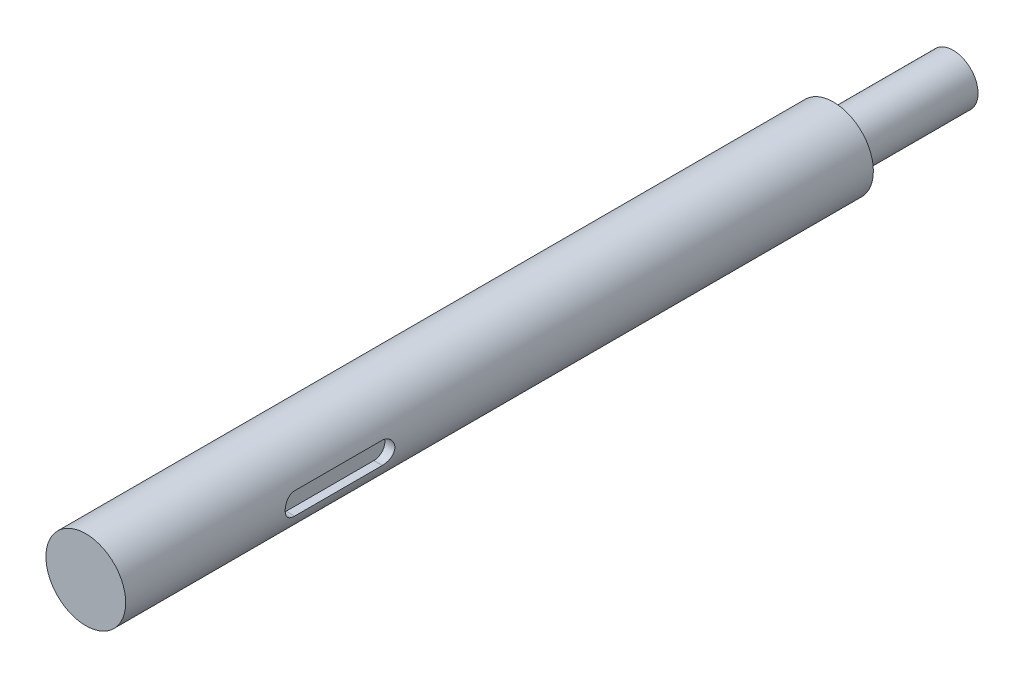
ISO-10303-21;
HEADER;
FILE_DESCRIPTION(('STEP AP214'),'2;1');
FILE_NAME('part.step','',(''),(''),'','','');
FILE_SCHEMA(('AUTOMOTIVE_DESIGN { 1 0 10303 214 1 1 1 1 }'));
ENDSEC;
DATA;
#1=APPLICATION_CONTEXT('core data for automotive mechanical design processes');
#2=APPLICATION_PROTOCOL_DEFINITION('international standard','automotive_design',2000,#1);
#3=PRODUCT_CONTEXT('',#1,'mechanical');
#4=PRODUCT('Part','Part','',(#3));
#5=PRODUCT_RELATED_PRODUCT_CATEGORY('part','',(#4));
#6=PRODUCT_DEFINITION_FORMATION('','',#4);
#7=PRODUCT_DEFINITION_CONTEXT('part definition',#1,'design');
#8=PRODUCT_DEFINITION('design','',#6,#7);
#9=PRODUCT_DEFINITION_SHAPE('','',#8);
#10=(LENGTH_UNIT() NAMED_UNIT(*) SI_UNIT(.MILLI.,.METRE.));
#11=(NAMED_UNIT(*) PLANE_ANGLE_UNIT() SI_UNIT($,.RADIAN.));
#12=(NAMED_UNIT(*) SI_UNIT($,.STERADIAN.) SOLID_ANGLE_UNIT());
#13=UNCERTAINTY_MEASURE_WITH_UNIT(LENGTH_MEASURE(1.E-05),#10,'distance_accuracy_value','');
#14=(GEOMETRIC_REPRESENTATION_CONTEXT(3) GLOBAL_UNCERTAINTY_ASSIGNED_CONTEXT((#13)) GLOBAL_UNIT_ASSIGNED_CONTEXT((#10,
#11,#12)) REPRESENTATION_CONTEXT('',''));
#15=CARTESIAN_POINT('',(0.,0.,0.));
#16=DIRECTION('',(0.,0.,1.));
#17=DIRECTION('',(1.,0.,0.));
#18=AXIS2_PLACEMENT_3D('',#15,#16,#17);
#19=CARTESIAN_POINT('',(0.,0.,75.));
#20=DIRECTION('',(0.,0.,-1.));
#21=DIRECTION('',(-1.,0.,0.));
#22=AXIS2_PLACEMENT_3D('',#19,#20,#21);
#23=CYLINDRICAL_SURFACE('',#22,4.);
#24=CARTESIAN_POINT('',(0.,0.,75.));
#25=DIRECTION('',(0.,0.,1.));
#26=DIRECTION('',(1.,0.,0.));
#27=AXIS2_PLACEMENT_3D('',#24,#25,#26);
#28=CIRCLE('',#27,4.);
#29=CARTESIAN_POINT('',(4.,0.,75.));
#30=VERTEX_POINT('',#29);
#31=EDGE_CURVE('E113',#30,#30,#28,.T.);
#32=ORIENTED_EDGE('',*,*,#31,.F.);
#33=EDGE_LOOP('',(#32));
#34=FACE_BOUND('',#33,.T.);
#35=CARTESIAN_POINT('',(0.,0.,0.));
#36=DIRECTION('',(0.,0.,1.));
#37=DIRECTION('',(1.,0.,0.));
#38=AXIS2_PLACEMENT_3D('',#35,#36,#37);
#39=CIRCLE('',#38,4.);
#40=CARTESIAN_POINT('',(4.,0.,0.));
#41=VERTEX_POINT('',#40);
#42=EDGE_CURVE('E108',#41,#41,#39,.T.);
#43=ORIENTED_EDGE('',*,*,#42,.T.);
#44=EDGE_LOOP('',(#43));
#45=FACE_BOUND('',#44,.T.);
#46=CARTESIAN_POINT('',(3.84577690460588,-1.1,49.1));
#47=CARTESIAN_POINT('',(3.84577460040045,-1.10000049269841,49.0696807589315));
#48=CARTESIAN_POINT('',(3.8461359051698,-1.09874566748106,49.0393766575331));
#49=CARTESIAN_POINT('',(3.84756203681956,-1.09374423671206,48.9789972986114));
#50=CARTESIAN_POINT('',(3.8486267265385,-1.08999811696688,48.9489219976278));
#51=CARTESIAN_POINT('',(3.85283178935487,-1.07508146609142,48.8595057773965));
#52=CARTESIAN_POINT('',(3.85698344992634,-1.06023236583058,48.8007828329138));
#53=CARTESIAN_POINT('',(3.86749429073186,-1.02121992442069,48.6867872682155));
#54=CARTESIAN_POINT('',(3.8738529957301,-0.997058588321974,48.6315139082323));
#55=CARTESIAN_POINT('',(3.88805746341656,-0.940141974920891,48.5257713764976));
#56=CARTESIAN_POINT('',(3.89590376528787,-0.907383579934376,48.4753039566655));
#57=CARTESIAN_POINT('',(3.91243077773866,-0.833280742703089,48.3793002677106));
#58=CARTESIAN_POINT('',(3.92112693966533,-0.791749945422331,48.3339105346198));
#59=CARTESIAN_POINT('',(3.9382414976702,-0.701678247007662,48.2506414673899));
#60=CARTESIAN_POINT('',(3.94665984806721,-0.653136199983694,48.2127633633269));
#61=CARTESIAN_POINT('',(3.96244402073585,-0.549393065255371,48.1449759516735));
#62=CARTESIAN_POINT('',(3.96978936402839,-0.494092230778886,48.1152141187069));
#63=CARTESIAN_POINT('',(3.98242060404427,-0.379038130327487,48.0654683298916));
#64=CARTESIAN_POINT('',(3.98770696570398,-0.319285873157936,48.0454821663488));
#65=CARTESIAN_POINT('',(3.99551517746231,-0.198562051593551,48.0163326555741));
#66=CARTESIAN_POINT('',(3.9981010136306,-0.137655284397289,48.0069183906103));
#67=CARTESIAN_POINT('',(4.00044095806972,-0.0150743060485403,47.9983894504216));
#68=CARTESIAN_POINT('',(4.0001955083333,0.0465997838154159,47.9992731675764));
#69=CARTESIAN_POINT('',(3.99694691239131,0.167212300268214,48.0111407920462));
#70=CARTESIAN_POINT('',(3.99401788272129,0.226179738834641,48.0218532551067));
#71=CARTESIAN_POINT('',(3.98581936328496,0.341444721358572,48.0526344602264));
#72=CARTESIAN_POINT('',(3.98054975923916,0.397742134802451,48.0727036591344));
#73=CARTESIAN_POINT('',(3.9681539914951,0.506751682908651,48.1218309757932));
#74=CARTESIAN_POINT('',(3.96100910185802,0.559420475085642,48.1509803471613));
#75=CARTESIAN_POINT('',(3.94562998514812,0.659209226826629,48.2173696725862));
#76=CARTESIAN_POINT('',(3.93739555434326,0.706328145503839,48.2546111406132));
#77=CARTESIAN_POINT('',(3.92041112186428,0.79529647866738,48.337555767899));
#78=CARTESIAN_POINT('',(3.91165306162229,0.836924921060689,48.3834945551086));
#79=CARTESIAN_POINT('',(3.8948461223239,0.911952002821714,48.4818034163998));
#80=CARTESIAN_POINT('',(3.88679744168146,0.945348344328879,48.5341752800743));
#81=CARTESIAN_POINT('',(3.87228478633302,1.00314930243698,48.6443761620977));
#82=CARTESIAN_POINT('',(3.86583304877767,1.02748516411955,48.7022428865896));
#83=CARTESIAN_POINT('',(3.85539806504079,1.06597848870995,48.8214362069388));
#84=CARTESIAN_POINT('',(3.85141109892312,1.08015129532198,48.8827574357255));
#85=CARTESIAN_POINT('',(3.84786904334958,1.09266385838806,48.9705257162275));
#86=CARTESIAN_POINT('',(3.84708593977816,1.09541503463923,48.9963581330875));
#87=CARTESIAN_POINT('',(3.8460399656814,1.09908122407721,49.0481228115318));
#88=CARTESIAN_POINT('',(3.84577628408222,1.09999909998117,49.0740548539989));
#89=CARTESIAN_POINT('',(3.84577690460588,1.1,49.1));
#90=B_SPLINE_CURVE_WITH_KNOTS('',3,(#46,#47,#48,#49,#50,#51,#52,#53,#54,#55,#56,#57,#58,#59,#60,
#61,#62,#63,#64,#65,#66,#67,#68,#69,#70,#71,#72,#73,#74,#75,#76,#77,#78,#79,#80,#81,#82,#83,#84,
#85,#86,#87,#88,#89),.UNSPECIFIED.,.F.,.F.,(4,2,2,2,2,2,2,2,2,2,2,2,2,2,2,2,2,2,2,2,2,4),(0.,
0.0908998964038968,0.181782072376462,0.362978852714695,0.54413664071091,0.725360215751237,
0.910911431607297,1.09649300758421,1.28525067794807,1.47396570040628,1.65810021684777,
1.84220598839281,2.02137546761453,2.20055369582064,2.38159411388996,2.56266843246602,
2.74962644608707,2.9366365871297,3.12503823887396,3.31315484832063,3.39106850263228,
3.46886039856523),.UNSPECIFIED.);
#91=CARTESIAN_POINT('',(3.84577690460588,-1.1,49.1));
#92=VERTEX_POINT('',#91);
#93=CARTESIAN_POINT('',(3.84577690460588,1.1,49.1));
#94=VERTEX_POINT('',#93);
#95=EDGE_CURVE('E112',#92,#94,#90,.T.);
#96=ORIENTED_EDGE('',*,*,#95,.F.);
#97=DIRECTION('',(0.,0.,-1.));
#98=VECTOR('',#97,1.);
#99=CARTESIAN_POINT('',(3.84577690460588,-1.1,75.));
#100=LINE('',#99,#98);
#101=CARTESIAN_POINT('',(3.84577690460588,-1.1,57.9));
#102=VERTEX_POINT('',#101);
#103=EDGE_CURVE('E11',#102,#92,#100,.T.);
#104=ORIENTED_EDGE('',*,*,#103,.F.);
#105=CARTESIAN_POINT('',(3.84577690460588,1.1,57.9));
#106=CARTESIAN_POINT('',(3.84577460040045,1.10000049269841,57.9303192410685));
#107=CARTESIAN_POINT('',(3.8461359051698,1.09874566748106,57.9606233424668));
#108=CARTESIAN_POINT('',(3.84756203681956,1.09374423671206,58.0210027013886));
#109=CARTESIAN_POINT('',(3.8486267265385,1.08999811696688,58.0510780023722));
#110=CARTESIAN_POINT('',(3.85283178935487,1.07508146609142,58.1404942226035));
#111=CARTESIAN_POINT('',(3.85698344992634,1.06023236583058,58.1992171670862));
#112=CARTESIAN_POINT('',(3.86749429073186,1.02121992442069,58.3132127317845));
#113=CARTESIAN_POINT('',(3.8738529957301,0.997058588321974,58.3684860917677));
#114=CARTESIAN_POINT('',(3.88805746341656,0.940141974920891,58.4742286235024));
#115=CARTESIAN_POINT('',(3.89590376528787,0.907383579934376,58.5246960433345));
#116=CARTESIAN_POINT('',(3.91243077773866,0.833280742703089,58.6206997322894));
#117=CARTESIAN_POINT('',(3.92112693966533,0.791749945422331,58.6660894653802));
#118=CARTESIAN_POINT('',(3.9382414976702,0.701678247007662,58.7493585326101));
#119=CARTESIAN_POINT('',(3.94665984806721,0.653136199983694,58.7872366366731));
#120=CARTESIAN_POINT('',(3.96244402073585,0.549393065255371,58.8550240483265));
#121=CARTESIAN_POINT('',(3.96978936402839,0.494092230778886,58.8847858812931));
#122=CARTESIAN_POINT('',(3.98242060404427,0.379038130327487,58.9345316701084));
#123=CARTESIAN_POINT('',(3.98770696570398,0.319285873157936,58.9545178336512));
#124=CARTESIAN_POINT('',(3.99551517746231,0.198562051593551,58.9836673444259));
#125=CARTESIAN_POINT('',(3.9981010136306,0.137655284397289,58.9930816093897));
#126=CARTESIAN_POINT('',(4.00044095806972,0.0150743060485413,59.0016105495784));
#127=CARTESIAN_POINT('',(4.0001955083333,-0.0465997838154154,59.0007268324236));
#128=CARTESIAN_POINT('',(3.99694691239131,-0.167212300268214,58.9888592079538));
#129=CARTESIAN_POINT('',(3.99401788272129,-0.226179738834641,58.9781467448933));
#130=CARTESIAN_POINT('',(3.98581936328496,-0.341444721358572,58.9473655397736));
#131=CARTESIAN_POINT('',(3.98054975923916,-0.397742134802451,58.9272963408656));
#132=CARTESIAN_POINT('',(3.9681539914951,-0.506751682908651,58.8781690242068));
#133=CARTESIAN_POINT('',(3.96100910185802,-0.559420475085642,58.8490196528387));
#134=CARTESIAN_POINT('',(3.94562998514812,-0.659209226826629,58.7826303274138));
#135=CARTESIAN_POINT('',(3.93739555434326,-0.706328145503839,58.7453888593867));
#136=CARTESIAN_POINT('',(3.92041112186428,-0.79529647866738,58.662444232101));
#137=CARTESIAN_POINT('',(3.91165306162229,-0.836924921060689,58.6165054448914));
#138=CARTESIAN_POINT('',(3.8948461223239,-0.911952002821714,58.5181965836002));
#139=CARTESIAN_POINT('',(3.88679744168146,-0.945348344328879,58.4658247199257));
#140=CARTESIAN_POINT('',(3.87228478633302,-1.00314930243698,58.3556238379023));
#141=CARTESIAN_POINT('',(3.86583304877767,-1.02748516411955,58.2977571134104));
#142=CARTESIAN_POINT('',(3.85539806504079,-1.06597848870995,58.1785637930612));
#143=CARTESIAN_POINT('',(3.85141109892312,-1.08015129532198,58.1172425642745));
#144=CARTESIAN_POINT('',(3.84786904334958,-1.09266385838806,58.0294742837725));
#145=CARTESIAN_POINT('',(3.84708593977816,-1.09541503463923,58.0036418669125));
#146=CARTESIAN_POINT('',(3.8460399656814,-1.09908122407721,57.9518771884682));
#147=CARTESIAN_POINT('',(3.84577628408222,-1.09999909998117,57.9259451460011));
#148=CARTESIAN_POINT('',(3.84577690460588,-1.1,57.9));
#149=B_SPLINE_CURVE_WITH_KNOTS('',3,(#105,#106,#107,#108,#109,#110,#111,#112,#113,#114,#115,
#116,#117,#118,#119,#120,#121,#122,#123,#124,#125,#126,#127,#128,#129,#130,#131,#132,#133,#134,
#135,#136,#137,#138,#139,#140,#141,#142,#143,#144,#145,#146,#147,#148),.UNSPECIFIED.,.F.,.F.,(4,
2,2,2,2,2,2,2,2,2,2,2,2,2,2,2,2,2,2,2,2,4),(0.,0.0908998964038898,0.181782072376462,
0.362978852714695,0.54413664071091,0.725360215751237,0.910911431607297,1.09649300758421,
1.28525067794807,1.47396570040628,1.65810021684777,1.84220598839281,2.02137546761453,
2.20055369582064,2.38159411388996,2.56266843246602,2.74962644608707,2.9366365871297,
3.12503823887396,3.31315484832063,3.39106850263228,3.46886039856523),.UNSPECIFIED.);
#150=CARTESIAN_POINT('',(3.84577690460588,1.1,57.9));
#151=VERTEX_POINT('',#150);
#152=EDGE_CURVE('E59',#151,#102,#149,.T.);
#153=ORIENTED_EDGE('',*,*,#152,.F.);
#154=DIRECTION('',(0.,0.,-1.));
#155=VECTOR('',#154,1.);
#156=CARTESIAN_POINT('',(3.84577690460588,1.1,75.));
#157=LINE('',#156,#155);
#158=EDGE_CURVE('E44',#94,#151,#157,.F.);
#159=ORIENTED_EDGE('',*,*,#158,.F.);
#160=EDGE_LOOP('',(#96,#104,#153,#159));
#161=FACE_BOUND('',#160,.T.);
#162=ADVANCED_FACE('F36',(#34,#45,#161),#23,.T.);
#163=CARTESIAN_POINT('',(0.,0.,75.));
#164=DIRECTION('',(0.,0.,1.));
#165=DIRECTION('',(1.,0.,0.));
#166=AXIS2_PLACEMENT_3D('',#163,#164,#165);
#167=PLANE('',#166);
#168=ORIENTED_EDGE('',*,*,#31,.T.);
#169=EDGE_LOOP('',(#168));
#170=FACE_BOUND('',#169,.T.);
#171=ADVANCED_FACE('F150',(#170),#167,.T.);
#172=CARTESIAN_POINT('',(0.,0.,0.));
#173=DIRECTION('',(0.,0.,1.));
#174=DIRECTION('',(1.,0.,0.));
#175=AXIS2_PLACEMENT_3D('',#172,#173,#174);
#176=PLANE('',#175);
#177=CARTESIAN_POINT('',(0.,0.,0.));
#178=DIRECTION('',(0.,0.,-1.));
#179=DIRECTION('',(-1.,0.,0.));
#180=AXIS2_PLACEMENT_3D('',#177,#178,#179);
#181=CIRCLE('',#180,2.5);
#182=CARTESIAN_POINT('',(-2.5,0.,0.));
#183=VERTEX_POINT('',#182);
#184=EDGE_CURVE('E109',#183,#183,#181,.T.);
#185=ORIENTED_EDGE('',*,*,#184,.F.);
#186=EDGE_LOOP('',(#185));
#187=FACE_BOUND('',#186,.T.);
#188=ORIENTED_EDGE('',*,*,#42,.F.);
#189=EDGE_LOOP('',(#188));
#190=FACE_BOUND('',#189,.T.);
#191=ADVANCED_FACE('F148',(#187,#190),#176,.F.);
#192=CARTESIAN_POINT('',(0.,0.,-12.));
#193=DIRECTION('',(0.,0.,1.));
#194=DIRECTION('',(1.,0.,0.));
#195=AXIS2_PLACEMENT_3D('',#192,#193,#194);
#196=CYLINDRICAL_SURFACE('',#195,2.5);
#197=CARTESIAN_POINT('',(0.,0.,-12.));
#198=DIRECTION('',(0.,0.,-1.));
#199=DIRECTION('',(-1.,0.,0.));
#200=AXIS2_PLACEMENT_3D('',#197,#198,#199);
#201=CIRCLE('',#200,2.5);
#202=CARTESIAN_POINT('',(-2.5,0.,-12.));
#203=VERTEX_POINT('',#202);
#204=EDGE_CURVE('E83',#203,#203,#201,.T.);
#205=ORIENTED_EDGE('',*,*,#204,.F.);
#206=EDGE_LOOP('',(#205));
#207=FACE_BOUND('',#206,.T.);
#208=ORIENTED_EDGE('',*,*,#184,.T.);
#209=EDGE_LOOP('',(#208));
#210=FACE_BOUND('',#209,.T.);
#211=ADVANCED_FACE('F144',(#207,#210),#196,.T.);
#212=CARTESIAN_POINT('',(0.,0.,-12.));
#213=DIRECTION('',(0.,0.,-1.));
#214=DIRECTION('',(-1.,0.,0.));
#215=AXIS2_PLACEMENT_3D('',#212,#213,#214);
#216=PLANE('',#215);
#217=ORIENTED_EDGE('',*,*,#204,.T.);
#218=EDGE_LOOP('',(#217));
#219=FACE_BOUND('',#218,.T.);
#220=ADVANCED_FACE('F141',(#219),#216,.T.);
#221=CARTESIAN_POINT('',(4.,0.,57.9));
#222=DIRECTION('',(-1.,0.,0.));
#223=DIRECTION('',(0.,0.,1.));
#224=AXIS2_PLACEMENT_3D('',#221,#222,#223);
#225=CYLINDRICAL_SURFACE('',#224,1.1);
#226=DIRECTION('',(-1.,0.,0.));
#227=VECTOR('',#226,1.);
#228=CARTESIAN_POINT('',(4.,1.1,57.9));
#229=LINE('',#228,#227);
#230=CARTESIAN_POINT('',(3.,1.1,57.9));
#231=VERTEX_POINT('',#230);
#232=EDGE_CURVE('E102',#151,#231,#229,.T.);
#233=ORIENTED_EDGE('',*,*,#232,.F.);
#234=ORIENTED_EDGE('',*,*,#152,.T.);
#235=DIRECTION('',(-1.,0.,0.));
#236=VECTOR('',#235,1.);
#237=CARTESIAN_POINT('',(4.,-1.1,57.9));
#238=LINE('',#237,#236);
#239=CARTESIAN_POINT('',(3.,-1.1,57.9));
#240=VERTEX_POINT('',#239);
#241=EDGE_CURVE('E76',#102,#240,#238,.T.);
#242=ORIENTED_EDGE('',*,*,#241,.T.);
#243=CARTESIAN_POINT('',(3.,0.,57.9));
#244=DIRECTION('',(1.,0.,0.));
#245=DIRECTION('',(0.,0.,-1.));
#246=AXIS2_PLACEMENT_3D('',#243,#244,#245);
#247=CIRCLE('',#246,1.1);
#248=EDGE_CURVE('E80',#231,#240,#247,.T.);
#249=ORIENTED_EDGE('',*,*,#248,.F.);
#250=EDGE_LOOP('',(#233,#234,#242,#249));
#251=FACE_BOUND('',#250,.T.);
#252=ADVANCED_FACE('F78',(#251),#225,.F.);
#253=CARTESIAN_POINT('',(4.,-1.1,57.9));
#254=DIRECTION('',(0.,1.,0.));
#255=DIRECTION('',(0.,0.,1.));
#256=AXIS2_PLACEMENT_3D('',#253,#254,#255);
#257=PLANE('',#256);
#258=ORIENTED_EDGE('',*,*,#103,.T.);
#259=DIRECTION('',(-1.,0.,0.));
#260=VECTOR('',#259,1.);
#261=CARTESIAN_POINT('',(4.,-1.1,49.1));
#262=LINE('',#261,#260);
#263=CARTESIAN_POINT('',(3.,-1.1,49.1));
#264=VERTEX_POINT('',#263);
#265=EDGE_CURVE('E84',#92,#264,#262,.T.);
#266=ORIENTED_EDGE('',*,*,#265,.T.);
#267=DIRECTION('',(0.,0.,-1.));
#268=VECTOR('',#267,1.);
#269=CARTESIAN_POINT('',(3.,-1.1,57.9));
#270=LINE('',#269,#268);
#271=EDGE_CURVE('E87',#240,#264,#270,.T.);
#272=ORIENTED_EDGE('',*,*,#271,.F.);
#273=ORIENTED_EDGE('',*,*,#241,.F.);
#274=EDGE_LOOP('',(#258,#266,#272,#273));
#275=FACE_BOUND('',#274,.T.);
#276=ADVANCED_FACE('F88',(#275),#257,.T.);
#277=CARTESIAN_POINT('',(4.,0.,49.1));
#278=DIRECTION('',(-1.,0.,0.));
#279=DIRECTION('',(0.,0.,1.));
#280=AXIS2_PLACEMENT_3D('',#277,#278,#279);
#281=CYLINDRICAL_SURFACE('',#280,1.1);
#282=ORIENTED_EDGE('',*,*,#265,.F.);
#283=ORIENTED_EDGE('',*,*,#95,.T.);
#284=DIRECTION('',(-1.,0.,0.));
#285=VECTOR('',#284,1.);
#286=CARTESIAN_POINT('',(4.,1.1,49.1));
#287=LINE('',#286,#285);
#288=CARTESIAN_POINT('',(3.,1.1,49.1));
#289=VERTEX_POINT('',#288);
#290=EDGE_CURVE('E51',#94,#289,#287,.T.);
#291=ORIENTED_EDGE('',*,*,#290,.T.);
#292=CARTESIAN_POINT('',(3.,0.,49.1));
#293=DIRECTION('',(1.,0.,0.));
#294=DIRECTION('',(0.,0.,-1.));
#295=AXIS2_PLACEMENT_3D('',#292,#293,#294);
#296=CIRCLE('',#295,1.1);
#297=EDGE_CURVE('E93',#264,#289,#296,.T.);
#298=ORIENTED_EDGE('',*,*,#297,.F.);
#299=EDGE_LOOP('',(#282,#283,#291,#298));
#300=FACE_BOUND('',#299,.T.);
#301=ADVANCED_FACE('F129',(#300),#281,.F.);
#302=CARTESIAN_POINT('',(4.,1.1,57.9));
#303=DIRECTION('',(0.,-1.,0.));
#304=DIRECTION('',(0.,0.,-1.));
#305=AXIS2_PLACEMENT_3D('',#302,#303,#304);
#306=PLANE('',#305);
#307=ORIENTED_EDGE('',*,*,#158,.T.);
#308=ORIENTED_EDGE('',*,*,#232,.T.);
#309=DIRECTION('',(0.,0.,1.));
#310=VECTOR('',#309,1.);
#311=CARTESIAN_POINT('',(3.,1.1,57.9));
#312=LINE('',#311,#310);
#313=EDGE_CURVE('E97',#289,#231,#312,.T.);
#314=ORIENTED_EDGE('',*,*,#313,.F.);
#315=ORIENTED_EDGE('',*,*,#290,.F.);
#316=EDGE_LOOP('',(#307,#308,#314,#315));
#317=FACE_BOUND('',#316,.T.);
#318=ADVANCED_FACE('F134',(#317),#306,.T.);
#319=CARTESIAN_POINT('',(3.,0.,57.9));
#320=DIRECTION('',(1.,0.,0.));
#321=DIRECTION('',(0.,0.,-1.));
#322=AXIS2_PLACEMENT_3D('',#319,#320,#321);
#323=PLANE('',#322);
#324=ORIENTED_EDGE('',*,*,#248,.T.);
#325=ORIENTED_EDGE('',*,*,#271,.T.);
#326=ORIENTED_EDGE('',*,*,#297,.T.);
#327=ORIENTED_EDGE('',*,*,#313,.T.);
#328=EDGE_LOOP('',(#324,#325,#326,#327));
#329=FACE_BOUND('',#328,.T.);
#330=ADVANCED_FACE('F96',(#329),#323,.T.);
#331=CLOSED_SHELL('',(#162,#171,#191,#211,#220,#252,#276,#301,#318,#330));
#332=MANIFOLD_SOLID_BREP('B2',#331);
#333=ADVANCED_BREP_SHAPE_REPRESENTATION('',(#18,#332),#14);
#334=SHAPE_DEFINITION_REPRESENTATION(#9,#333);
ENDSEC;
END-ISO-10303-21;
